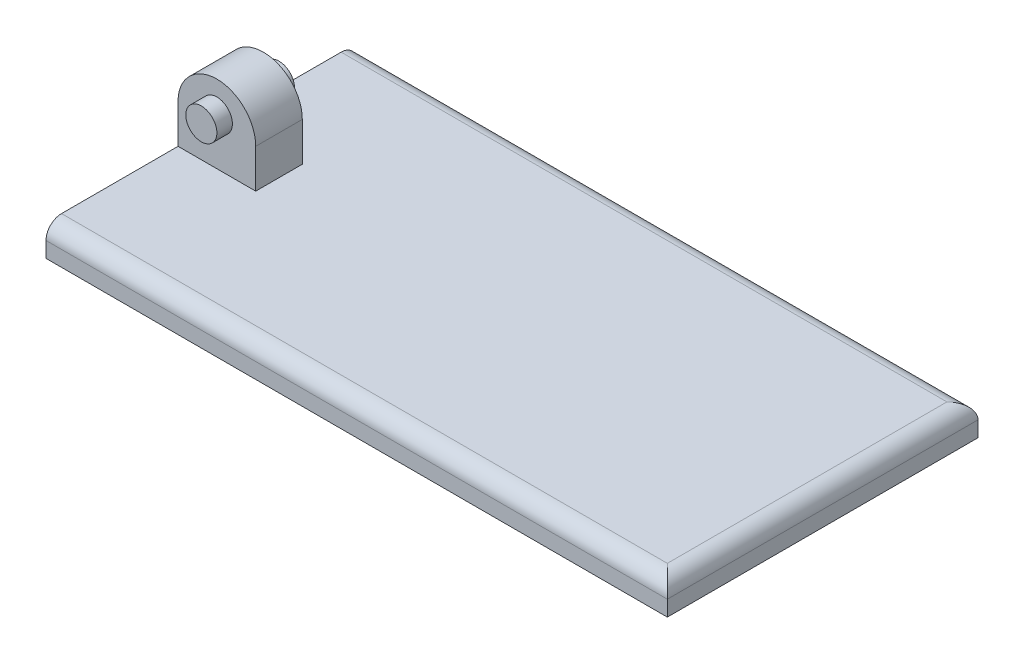
ISO-10303-21;
HEADER;
FILE_DESCRIPTION(('STEP AP214'),'2;1');
FILE_NAME('part.step','',(''),(''),'','','');
FILE_SCHEMA(('AUTOMOTIVE_DESIGN { 1 0 10303 214 1 1 1 1 }'));
ENDSEC;
DATA;
#1=APPLICATION_CONTEXT('core data for automotive mechanical design processes');
#2=APPLICATION_PROTOCOL_DEFINITION('international standard','automotive_design',2000,#1);
#3=PRODUCT_CONTEXT('',#1,'mechanical');
#4=PRODUCT('Part','Part','',(#3));
#5=PRODUCT_RELATED_PRODUCT_CATEGORY('part','',(#4));
#6=PRODUCT_DEFINITION_FORMATION('','',#4);
#7=PRODUCT_DEFINITION_CONTEXT('part definition',#1,'design');
#8=PRODUCT_DEFINITION('design','',#6,#7);
#9=PRODUCT_DEFINITION_SHAPE('','',#8);
#10=(LENGTH_UNIT() NAMED_UNIT(*) SI_UNIT(.MILLI.,.METRE.));
#11=(NAMED_UNIT(*) PLANE_ANGLE_UNIT() SI_UNIT($,.RADIAN.));
#12=(NAMED_UNIT(*) SI_UNIT($,.STERADIAN.) SOLID_ANGLE_UNIT());
#13=UNCERTAINTY_MEASURE_WITH_UNIT(LENGTH_MEASURE(1.E-05),#10,'distance_accuracy_value','');
#14=(GEOMETRIC_REPRESENTATION_CONTEXT(3) GLOBAL_UNCERTAINTY_ASSIGNED_CONTEXT((#13)) GLOBAL_UNIT_ASSIGNED_CONTEXT((#10,
#11,#12)) REPRESENTATION_CONTEXT('',''));
#15=CARTESIAN_POINT('',(0.,0.,0.));
#16=DIRECTION('',(0.,0.,1.));
#17=DIRECTION('',(1.,0.,0.));
#18=AXIS2_PLACEMENT_3D('',#15,#16,#17);
#19=CARTESIAN_POINT('',(-87.5,22.5,7.5));
#20=DIRECTION('',(0.,0.,-1.));
#21=DIRECTION('',(-1.,0.,0.));
#22=AXIS2_PLACEMENT_3D('',#19,#20,#21);
#23=CYLINDRICAL_SURFACE('',#22,12.5);
#24=DIRECTION('',(0.,0.,-1.));
#25=VECTOR('',#24,1.);
#26=CARTESIAN_POINT('',(-100.,22.5,-50.));
#27=LINE('',#26,#25);
#28=CARTESIAN_POINT('',(-100.,22.5,7.5));
#29=VERTEX_POINT('',#28);
#30=CARTESIAN_POINT('',(-100.,22.5,-7.5));
#31=VERTEX_POINT('',#30);
#32=EDGE_CURVE('E188',#29,#31,#27,.T.);
#33=ORIENTED_EDGE('',*,*,#32,.F.);
#34=CARTESIAN_POINT('',(-87.5,22.5,7.5));
#35=DIRECTION('',(0.,0.,1.));
#36=DIRECTION('',(1.,0.,0.));
#37=AXIS2_PLACEMENT_3D('',#34,#35,#36);
#38=CIRCLE('',#37,12.5);
#39=CARTESIAN_POINT('',(-75.,22.5,7.5));
#40=VERTEX_POINT('',#39);
#41=EDGE_CURVE('E47',#40,#29,#38,.T.);
#42=ORIENTED_EDGE('',*,*,#41,.F.);
#43=DIRECTION('',(0.,0.,-1.));
#44=VECTOR('',#43,1.);
#45=CARTESIAN_POINT('',(-75.,22.5,7.5));
#46=LINE('',#45,#44);
#47=CARTESIAN_POINT('',(-75.,22.5,-7.5));
#48=VERTEX_POINT('',#47);
#49=EDGE_CURVE('E190',#48,#40,#46,.F.);
#50=ORIENTED_EDGE('',*,*,#49,.F.);
#51=CARTESIAN_POINT('',(-87.5,22.5,-7.5));
#52=DIRECTION('',(0.,0.,1.));
#53=DIRECTION('',(1.,0.,0.));
#54=AXIS2_PLACEMENT_3D('',#51,#52,#53);
#55=CIRCLE('',#54,12.5);
#56=EDGE_CURVE('E11',#31,#48,#55,.F.);
#57=ORIENTED_EDGE('',*,*,#56,.F.);
#58=EDGE_LOOP('',(#33,#42,#50,#57));
#59=FACE_BOUND('',#58,.T.);
#60=ADVANCED_FACE('F39',(#59),#23,.T.);
#61=CARTESIAN_POINT('',(100.,10.,-50.));
#62=DIRECTION('',(-1.,0.,0.));
#63=DIRECTION('',(0.,0.,1.));
#64=AXIS2_PLACEMENT_3D('',#61,#62,#63);
#65=PLANE('',#64);
#66=DIRECTION('',(0.,-1.,0.));
#67=VECTOR('',#66,1.);
#68=CARTESIAN_POINT('',(100.,10.,-50.));
#69=LINE('',#68,#67);
#70=CARTESIAN_POINT('',(100.,5.,-50.));
#71=VERTEX_POINT('',#70);
#72=CARTESIAN_POINT('',(100.,0.,-50.));
#73=VERTEX_POINT('',#72);
#74=EDGE_CURVE('E162',#71,#73,#69,.T.);
#75=ORIENTED_EDGE('',*,*,#74,.F.);
#76=DIRECTION('',(0.,0.,-1.));
#77=VECTOR('',#76,1.);
#78=CARTESIAN_POINT('',(100.,5.,50.));
#79=LINE('',#78,#77);
#80=CARTESIAN_POINT('',(100.,5.,50.));
#81=VERTEX_POINT('',#80);
#82=EDGE_CURVE('E176',#71,#81,#79,.F.);
#83=ORIENTED_EDGE('',*,*,#82,.T.);
#84=DIRECTION('',(0.,-1.,0.));
#85=VECTOR('',#84,1.);
#86=CARTESIAN_POINT('',(100.,10.,50.));
#87=LINE('',#86,#85);
#88=CARTESIAN_POINT('',(100.,0.,50.));
#89=VERTEX_POINT('',#88);
#90=EDGE_CURVE('E141',#81,#89,#87,.T.);
#91=ORIENTED_EDGE('',*,*,#90,.T.);
#92=DIRECTION('',(0.,0.,-1.));
#93=VECTOR('',#92,1.);
#94=CARTESIAN_POINT('',(100.,0.,-50.));
#95=LINE('',#94,#93);
#96=EDGE_CURVE('E148',#89,#73,#95,.T.);
#97=ORIENTED_EDGE('',*,*,#96,.T.);
#98=EDGE_LOOP('',(#75,#83,#91,#97));
#99=FACE_BOUND('',#98,.T.);
#100=ADVANCED_FACE('F232',(#99),#65,.F.);
#101=CARTESIAN_POINT('',(-100.,10.,-50.));
#102=DIRECTION('',(0.,0.,1.));
#103=DIRECTION('',(1.,0.,0.));
#104=AXIS2_PLACEMENT_3D('',#101,#102,#103);
#105=PLANE('',#104);
#106=DIRECTION('',(0.,-1.,0.));
#107=VECTOR('',#106,1.);
#108=CARTESIAN_POINT('',(-100.,10.,-50.));
#109=LINE('',#108,#107);
#110=CARTESIAN_POINT('',(-100.,5.,-50.));
#111=VERTEX_POINT('',#110);
#112=CARTESIAN_POINT('',(-100.,0.,-50.));
#113=VERTEX_POINT('',#112);
#114=EDGE_CURVE('E160',#111,#113,#109,.T.);
#115=ORIENTED_EDGE('',*,*,#114,.F.);
#116=DIRECTION('',(-1.,0.,0.));
#117=VECTOR('',#116,1.);
#118=CARTESIAN_POINT('',(100.,5.,-50.));
#119=LINE('',#118,#117);
#120=EDGE_CURVE('E174',#111,#71,#119,.F.);
#121=ORIENTED_EDGE('',*,*,#120,.T.);
#122=ORIENTED_EDGE('',*,*,#74,.T.);
#123=DIRECTION('',(-1.,0.,0.));
#124=VECTOR('',#123,1.);
#125=CARTESIAN_POINT('',(-100.,0.,-50.));
#126=LINE('',#125,#124);
#127=EDGE_CURVE('E151',#73,#113,#126,.T.);
#128=ORIENTED_EDGE('',*,*,#127,.T.);
#129=EDGE_LOOP('',(#115,#121,#122,#128));
#130=FACE_BOUND('',#129,.T.);
#131=ADVANCED_FACE('F214',(#130),#105,.F.);
#132=CARTESIAN_POINT('',(-100.,10.,-50.));
#133=DIRECTION('',(1.,0.,0.));
#134=DIRECTION('',(0.,0.,-1.));
#135=AXIS2_PLACEMENT_3D('',#132,#133,#134);
#136=PLANE('',#135);
#137=DIRECTION('',(0.,-1.,0.));
#138=VECTOR('',#137,1.);
#139=CARTESIAN_POINT('',(-100.,35.,7.5));
#140=LINE('',#139,#138);
#141=CARTESIAN_POINT('',(-100.,10.,7.5));
#142=VERTEX_POINT('',#141);
#143=EDGE_CURVE('E112',#29,#142,#140,.T.);
#144=ORIENTED_EDGE('',*,*,#143,.F.);
#145=ORIENTED_EDGE('',*,*,#32,.T.);
#146=DIRECTION('',(0.,-1.,0.));
#147=VECTOR('',#146,1.);
#148=CARTESIAN_POINT('',(-100.,35.,-7.5));
#149=LINE('',#148,#147);
#150=CARTESIAN_POINT('',(-100.,10.,-7.5));
#151=VERTEX_POINT('',#150);
#152=EDGE_CURVE('E197',#31,#151,#149,.T.);
#153=ORIENTED_EDGE('',*,*,#152,.T.);
#154=DIRECTION('',(0.,0.,1.));
#155=VECTOR('',#154,1.);
#156=CARTESIAN_POINT('',(-100.,10.,-50.));
#157=LINE('',#156,#155);
#158=CARTESIAN_POINT('',(-100.,10.,-45.));
#159=VERTEX_POINT('',#158);
#160=EDGE_CURVE('E137',#159,#151,#157,.T.);
#161=ORIENTED_EDGE('',*,*,#160,.F.);
#162=CARTESIAN_POINT('',(-100.,5.,-45.));
#163=DIRECTION('',(1.,0.,0.));
#164=DIRECTION('',(0.,0.,-1.));
#165=AXIS2_PLACEMENT_3D('',#162,#163,#164);
#166=CIRCLE('',#165,5.);
#167=EDGE_CURVE('E172',#159,#111,#166,.F.);
#168=ORIENTED_EDGE('',*,*,#167,.T.);
#169=ORIENTED_EDGE('',*,*,#114,.T.);
#170=DIRECTION('',(0.,0.,1.));
#171=VECTOR('',#170,1.);
#172=CARTESIAN_POINT('',(-100.,0.,-50.));
#173=LINE('',#172,#171);
#174=CARTESIAN_POINT('',(-100.,0.,50.));
#175=VERTEX_POINT('',#174);
#176=EDGE_CURVE('E143',#113,#175,#173,.T.);
#177=ORIENTED_EDGE('',*,*,#176,.T.);
#178=DIRECTION('',(0.,-1.,0.));
#179=VECTOR('',#178,1.);
#180=CARTESIAN_POINT('',(-100.,10.,50.));
#181=LINE('',#180,#179);
#182=CARTESIAN_POINT('',(-100.,5.,50.));
#183=VERTEX_POINT('',#182);
#184=EDGE_CURVE('E158',#183,#175,#181,.T.);
#185=ORIENTED_EDGE('',*,*,#184,.F.);
#186=CARTESIAN_POINT('',(-100.,5.,45.));
#187=DIRECTION('',(1.,0.,0.));
#188=DIRECTION('',(0.,0.,-1.));
#189=AXIS2_PLACEMENT_3D('',#186,#187,#188);
#190=CIRCLE('',#189,5.);
#191=CARTESIAN_POINT('',(-100.,10.,45.));
#192=VERTEX_POINT('',#191);
#193=EDGE_CURVE('E135',#183,#192,#190,.F.);
#194=ORIENTED_EDGE('',*,*,#193,.T.);
#195=EDGE_CURVE('E126',#142,#192,#157,.T.);
#196=ORIENTED_EDGE('',*,*,#195,.F.);
#197=EDGE_LOOP('',(#144,#145,#153,#161,#168,#169,#177,#185,#194,#196));
#198=FACE_BOUND('',#197,.T.);
#199=ADVANCED_FACE('F132',(#198),#136,.F.);
#200=CARTESIAN_POINT('',(-100.,10.,50.));
#201=DIRECTION('',(0.,0.,-1.));
#202=DIRECTION('',(-1.,0.,0.));
#203=AXIS2_PLACEMENT_3D('',#200,#201,#202);
#204=PLANE('',#203);
#205=ORIENTED_EDGE('',*,*,#90,.F.);
#206=DIRECTION('',(1.,0.,0.));
#207=VECTOR('',#206,1.);
#208=CARTESIAN_POINT('',(-100.,5.,50.));
#209=LINE('',#208,#207);
#210=EDGE_CURVE('E178',#81,#183,#209,.F.);
#211=ORIENTED_EDGE('',*,*,#210,.T.);
#212=ORIENTED_EDGE('',*,*,#184,.T.);
#213=DIRECTION('',(1.,0.,0.));
#214=VECTOR('',#213,1.);
#215=CARTESIAN_POINT('',(-100.,0.,50.));
#216=LINE('',#215,#214);
#217=EDGE_CURVE('E138',#175,#89,#216,.T.);
#218=ORIENTED_EDGE('',*,*,#217,.T.);
#219=EDGE_LOOP('',(#205,#211,#212,#218));
#220=FACE_BOUND('',#219,.T.);
#221=ADVANCED_FACE('F233',(#220),#204,.F.);
#222=CARTESIAN_POINT('',(0.,10.,0.));
#223=DIRECTION('',(0.,1.,0.));
#224=DIRECTION('',(0.,0.,1.));
#225=AXIS2_PLACEMENT_3D('',#222,#223,#224);
#226=PLANE('',#225);
#227=DIRECTION('',(1.,0.,0.));
#228=VECTOR('',#227,1.);
#229=CARTESIAN_POINT('',(-100.,10.,7.5));
#230=LINE('',#229,#228);
#231=CARTESIAN_POINT('',(-75.,10.,7.5));
#232=VERTEX_POINT('',#231);
#233=EDGE_CURVE('E116',#142,#232,#230,.T.);
#234=ORIENTED_EDGE('',*,*,#233,.F.);
#235=ORIENTED_EDGE('',*,*,#195,.T.);
#236=DIRECTION('',(1.,0.,0.));
#237=VECTOR('',#236,1.);
#238=CARTESIAN_POINT('',(100.,10.,45.));
#239=LINE('',#238,#237);
#240=CARTESIAN_POINT('',(95.,10.,45.));
#241=VERTEX_POINT('',#240);
#242=EDGE_CURVE('E164',#192,#241,#239,.T.);
#243=ORIENTED_EDGE('',*,*,#242,.T.);
#244=DIRECTION('',(0.,0.,-1.));
#245=VECTOR('',#244,1.);
#246=CARTESIAN_POINT('',(95.,10.,-50.));
#247=LINE('',#246,#245);
#248=CARTESIAN_POINT('',(95.,10.,-45.));
#249=VERTEX_POINT('',#248);
#250=EDGE_CURVE('E166',#241,#249,#247,.T.);
#251=ORIENTED_EDGE('',*,*,#250,.T.);
#252=DIRECTION('',(-1.,0.,0.));
#253=VECTOR('',#252,1.);
#254=CARTESIAN_POINT('',(-100.,10.,-45.));
#255=LINE('',#254,#253);
#256=EDGE_CURVE('E168',#249,#159,#255,.T.);
#257=ORIENTED_EDGE('',*,*,#256,.T.);
#258=ORIENTED_EDGE('',*,*,#160,.T.);
#259=DIRECTION('',(1.,0.,0.));
#260=VECTOR('',#259,1.);
#261=CARTESIAN_POINT('',(-100.,10.,-7.5));
#262=LINE('',#261,#260);
#263=CARTESIAN_POINT('',(-75.,10.,-7.5));
#264=VERTEX_POINT('',#263);
#265=EDGE_CURVE('E195',#151,#264,#262,.T.);
#266=ORIENTED_EDGE('',*,*,#265,.T.);
#267=DIRECTION('',(0.,0.,-1.));
#268=VECTOR('',#267,1.);
#269=CARTESIAN_POINT('',(-75.,10.,7.5));
#270=LINE('',#269,#268);
#271=EDGE_CURVE('E130',#232,#264,#270,.T.);
#272=ORIENTED_EDGE('',*,*,#271,.F.);
#273=EDGE_LOOP('',(#234,#235,#243,#251,#257,#258,#266,#272));
#274=FACE_BOUND('',#273,.T.);
#275=ADVANCED_FACE('F125',(#274),#226,.T.);
#276=CARTESIAN_POINT('',(0.,0.,0.));
#277=DIRECTION('',(0.,1.,0.));
#278=DIRECTION('',(0.,0.,1.));
#279=AXIS2_PLACEMENT_3D('',#276,#277,#278);
#280=PLANE('',#279);
#281=ORIENTED_EDGE('',*,*,#96,.F.);
#282=ORIENTED_EDGE('',*,*,#217,.F.);
#283=ORIENTED_EDGE('',*,*,#176,.F.);
#284=ORIENTED_EDGE('',*,*,#127,.F.);
#285=EDGE_LOOP('',(#281,#282,#283,#284));
#286=FACE_BOUND('',#285,.T.);
#287=ADVANCED_FACE('F221',(#286),#280,.F.);
#288=CARTESIAN_POINT('',(0.,5.,45.));
#289=DIRECTION('',(-1.,0.,0.));
#290=DIRECTION('',(0.,0.,1.));
#291=AXIS2_PLACEMENT_3D('',#288,#289,#290);
#292=CYLINDRICAL_SURFACE('',#291,5.);
#293=ORIENTED_EDGE('',*,*,#193,.F.);
#294=ORIENTED_EDGE('',*,*,#210,.F.);
#295=CARTESIAN_POINT('',(95.,5.,45.));
#296=DIRECTION('',(-0.707106781186547,0.,0.707106781186547));
#297=DIRECTION('',(-0.707106781186547,0.,-0.707106781186547));
#298=AXIS2_PLACEMENT_3D('',#295,#296,#297);
#299=ELLIPSE('',#298,7.07106781186547,5.);
#300=EDGE_CURVE('E152',#241,#81,#299,.F.);
#301=ORIENTED_EDGE('',*,*,#300,.F.);
#302=ORIENTED_EDGE('',*,*,#242,.F.);
#303=EDGE_LOOP('',(#293,#294,#301,#302));
#304=FACE_BOUND('',#303,.T.);
#305=ADVANCED_FACE('F225',(#304),#292,.T.);
#306=CARTESIAN_POINT('',(95.,5.,0.));
#307=DIRECTION('',(0.,0.,1.));
#308=DIRECTION('',(1.,0.,0.));
#309=AXIS2_PLACEMENT_3D('',#306,#307,#308);
#310=CYLINDRICAL_SURFACE('',#309,5.);
#311=ORIENTED_EDGE('',*,*,#300,.T.);
#312=ORIENTED_EDGE('',*,*,#82,.F.);
#313=CARTESIAN_POINT('',(95.,5.,-45.));
#314=DIRECTION('',(0.707106781186547,0.,0.707106781186547));
#315=DIRECTION('',(-0.707106781186547,0.,0.707106781186547));
#316=AXIS2_PLACEMENT_3D('',#313,#314,#315);
#317=ELLIPSE('',#316,7.07106781186547,5.);
#318=EDGE_CURVE('E181',#249,#71,#317,.F.);
#319=ORIENTED_EDGE('',*,*,#318,.F.);
#320=ORIENTED_EDGE('',*,*,#250,.F.);
#321=EDGE_LOOP('',(#311,#312,#319,#320));
#322=FACE_BOUND('',#321,.T.);
#323=ADVANCED_FACE('F229',(#322),#310,.T.);
#324=CARTESIAN_POINT('',(0.,5.,-45.));
#325=DIRECTION('',(1.,0.,0.));
#326=DIRECTION('',(0.,0.,-1.));
#327=AXIS2_PLACEMENT_3D('',#324,#325,#326);
#328=CYLINDRICAL_SURFACE('',#327,5.);
#329=ORIENTED_EDGE('',*,*,#318,.T.);
#330=ORIENTED_EDGE('',*,*,#120,.F.);
#331=ORIENTED_EDGE('',*,*,#167,.F.);
#332=ORIENTED_EDGE('',*,*,#256,.F.);
#333=EDGE_LOOP('',(#329,#330,#331,#332));
#334=FACE_BOUND('',#333,.T.);
#335=ADVANCED_FACE('F210',(#334),#328,.T.);
#336=CARTESIAN_POINT('',(-75.,35.,7.5));
#337=DIRECTION('',(-1.,0.,0.));
#338=DIRECTION('',(0.,0.,1.));
#339=AXIS2_PLACEMENT_3D('',#336,#337,#338);
#340=PLANE('',#339);
#341=DIRECTION('',(0.,1.,0.));
#342=VECTOR('',#341,1.);
#343=CARTESIAN_POINT('',(-75.,35.,-7.5));
#344=LINE('',#343,#342);
#345=EDGE_CURVE('E194',#264,#48,#344,.T.);
#346=ORIENTED_EDGE('',*,*,#345,.T.);
#347=ORIENTED_EDGE('',*,*,#49,.T.);
#348=DIRECTION('',(0.,1.,0.));
#349=VECTOR('',#348,1.);
#350=CARTESIAN_POINT('',(-75.,35.,7.5));
#351=LINE('',#350,#349);
#352=EDGE_CURVE('E121',#232,#40,#351,.T.);
#353=ORIENTED_EDGE('',*,*,#352,.F.);
#354=ORIENTED_EDGE('',*,*,#271,.T.);
#355=EDGE_LOOP('',(#346,#347,#353,#354));
#356=FACE_BOUND('',#355,.T.);
#357=ADVANCED_FACE('F193',(#356),#340,.F.);
#358=CARTESIAN_POINT('',(0.,0.,7.5));
#359=DIRECTION('',(0.,0.,1.));
#360=DIRECTION('',(1.,0.,0.));
#361=AXIS2_PLACEMENT_3D('',#358,#359,#360);
#362=PLANE('',#361);
#363=CARTESIAN_POINT('',(-87.5,25.,7.5));
#364=DIRECTION('',(0.,0.,1.));
#365=DIRECTION('',(1.,0.,0.));
#366=AXIS2_PLACEMENT_3D('',#363,#364,#365);
#367=CIRCLE('',#366,5.);
#368=CARTESIAN_POINT('',(-82.5,25.,7.5));
#369=VERTEX_POINT('',#368);
#370=EDGE_CURVE('E199',#369,#369,#367,.F.);
#371=ORIENTED_EDGE('',*,*,#370,.T.);
#372=EDGE_LOOP('',(#371));
#373=FACE_BOUND('',#372,.T.);
#374=ORIENTED_EDGE('',*,*,#352,.T.);
#375=ORIENTED_EDGE('',*,*,#41,.T.);
#376=ORIENTED_EDGE('',*,*,#143,.T.);
#377=ORIENTED_EDGE('',*,*,#233,.T.);
#378=EDGE_LOOP('',(#374,#375,#376,#377));
#379=FACE_BOUND('',#378,.T.);
#380=ADVANCED_FACE('F115',(#373,#379),#362,.T.);
#381=CARTESIAN_POINT('',(0.,0.,-7.5));
#382=DIRECTION('',(0.,0.,1.));
#383=DIRECTION('',(1.,0.,0.));
#384=AXIS2_PLACEMENT_3D('',#381,#382,#383);
#385=PLANE('',#384);
#386=CARTESIAN_POINT('',(-87.5,25.,-7.5));
#387=DIRECTION('',(0.,0.,1.));
#388=DIRECTION('',(1.,0.,0.));
#389=AXIS2_PLACEMENT_3D('',#386,#387,#388);
#390=CIRCLE('',#389,5.);
#391=CARTESIAN_POINT('',(-82.5,25.,-7.5));
#392=VERTEX_POINT('',#391);
#393=EDGE_CURVE('E180',#392,#392,#390,.F.);
#394=ORIENTED_EDGE('',*,*,#393,.F.);
#395=EDGE_LOOP('',(#394));
#396=FACE_BOUND('',#395,.T.);
#397=ORIENTED_EDGE('',*,*,#152,.F.);
#398=ORIENTED_EDGE('',*,*,#56,.T.);
#399=ORIENTED_EDGE('',*,*,#345,.F.);
#400=ORIENTED_EDGE('',*,*,#265,.F.);
#401=EDGE_LOOP('',(#397,#398,#399,#400));
#402=FACE_BOUND('',#401,.T.);
#403=ADVANCED_FACE('F205',(#396,#402),#385,.F.);
#404=CARTESIAN_POINT('',(-87.5,25.,-12.5));
#405=DIRECTION('',(0.,0.,1.));
#406=DIRECTION('',(1.,0.,0.));
#407=AXIS2_PLACEMENT_3D('',#404,#405,#406);
#408=PLANE('',#407);
#409=CARTESIAN_POINT('',(-87.5,25.,-12.5));
#410=DIRECTION('',(0.,0.,1.));
#411=DIRECTION('',(1.,0.,0.));
#412=AXIS2_PLACEMENT_3D('',#409,#410,#411);
#413=CIRCLE('',#412,5.);
#414=CARTESIAN_POINT('',(-82.5,25.,-12.5));
#415=VERTEX_POINT('',#414);
#416=EDGE_CURVE('E289',#415,#415,#413,.T.);
#417=ORIENTED_EDGE('',*,*,#416,.F.);
#418=EDGE_LOOP('',(#417));
#419=FACE_BOUND('',#418,.T.);
#420=ADVANCED_FACE('F267',(#419),#408,.F.);
#421=CARTESIAN_POINT('',(-87.5,25.,12.5));
#422=DIRECTION('',(0.,0.,-1.));
#423=DIRECTION('',(-1.,0.,0.));
#424=AXIS2_PLACEMENT_3D('',#421,#422,#423);
#425=CYLINDRICAL_SURFACE('',#424,5.);
#426=ORIENTED_EDGE('',*,*,#416,.T.);
#427=EDGE_LOOP('',(#426));
#428=FACE_BOUND('',#427,.T.);
#429=ORIENTED_EDGE('',*,*,#393,.T.);
#430=EDGE_LOOP('',(#429));
#431=FACE_BOUND('',#430,.T.);
#432=ADVANCED_FACE('F276',(#428,#431),#425,.T.);
#433=ORIENTED_EDGE('',*,*,#370,.F.);
#434=EDGE_LOOP('',(#433));
#435=FACE_BOUND('',#434,.T.);
#436=CARTESIAN_POINT('',(-87.5,25.,12.5));
#437=DIRECTION('',(0.,0.,1.));
#438=DIRECTION('',(1.,0.,0.));
#439=AXIS2_PLACEMENT_3D('',#436,#437,#438);
#440=CIRCLE('',#439,5.);
#441=CARTESIAN_POINT('',(-82.5,25.,12.5));
#442=VERTEX_POINT('',#441);
#443=EDGE_CURVE('E287',#442,#442,#440,.T.);
#444=ORIENTED_EDGE('',*,*,#443,.F.);
#445=EDGE_LOOP('',(#444));
#446=FACE_BOUND('',#445,.T.);
#447=ADVANCED_FACE('F272',(#435,#446),#425,.T.);
#448=CARTESIAN_POINT('',(-87.5,25.,12.5));
#449=DIRECTION('',(0.,0.,1.));
#450=DIRECTION('',(1.,0.,0.));
#451=AXIS2_PLACEMENT_3D('',#448,#449,#450);
#452=PLANE('',#451);
#453=ORIENTED_EDGE('',*,*,#443,.T.);
#454=EDGE_LOOP('',(#453));
#455=FACE_BOUND('',#454,.T.);
#456=ADVANCED_FACE('F275',(#455),#452,.T.);
#457=CLOSED_SHELL('',(#60,#100,#131,#199,#221,#275,#287,#305,#323,#335,#357,#380,#403,#420,#432,
#447,#456));
#458=MANIFOLD_SOLID_BREP('B2',#457);
#459=ADVANCED_BREP_SHAPE_REPRESENTATION('',(#18,#458),#14);
#460=SHAPE_DEFINITION_REPRESENTATION(#9,#459);
ENDSEC;
END-ISO-10303-21;
